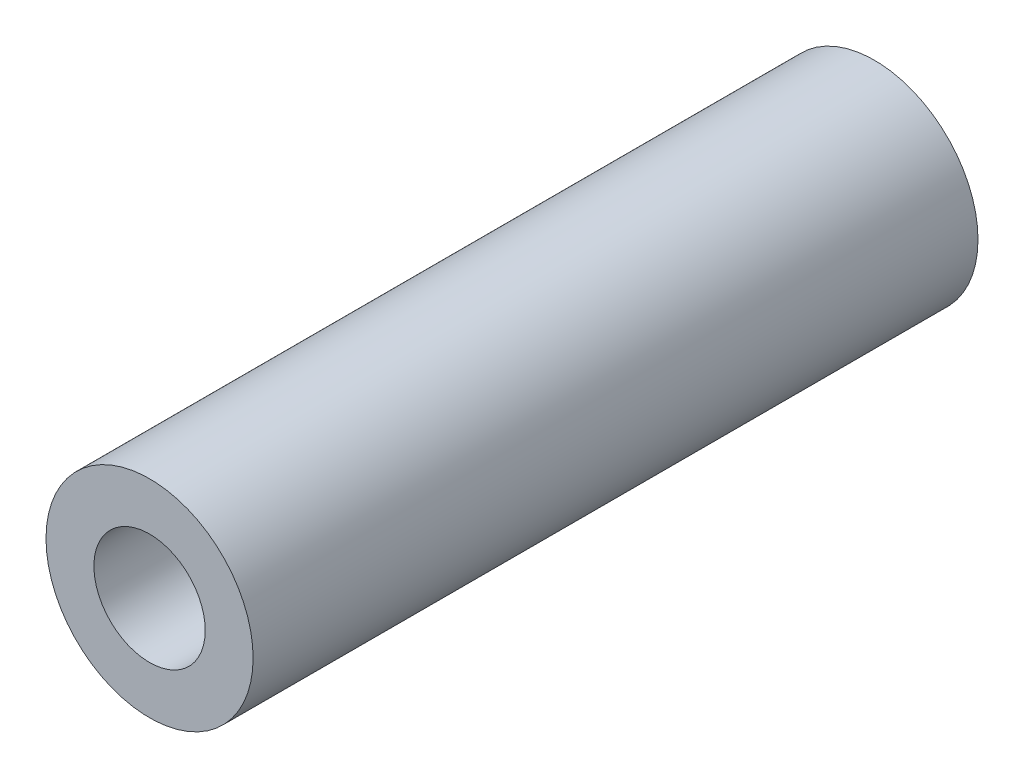
ISO-10303-21;
HEADER;
FILE_DESCRIPTION(('STEP AP214'),'2;1');
FILE_NAME('part.step','',(''),(''),'','','');
FILE_SCHEMA(('AUTOMOTIVE_DESIGN { 1 0 10303 214 1 1 1 1 }'));
ENDSEC;
DATA;
#1=APPLICATION_CONTEXT('core data for automotive mechanical design processes');
#2=APPLICATION_PROTOCOL_DEFINITION('international standard','automotive_design',2000,#1);
#3=PRODUCT_CONTEXT('',#1,'mechanical');
#4=PRODUCT('Part','Part','',(#3));
#5=PRODUCT_RELATED_PRODUCT_CATEGORY('part','',(#4));
#6=PRODUCT_DEFINITION_FORMATION('','',#4);
#7=PRODUCT_DEFINITION_CONTEXT('part definition',#1,'design');
#8=PRODUCT_DEFINITION('design','',#6,#7);
#9=PRODUCT_DEFINITION_SHAPE('','',#8);
#10=(LENGTH_UNIT() NAMED_UNIT(*) SI_UNIT(.MILLI.,.METRE.));
#11=(NAMED_UNIT(*) PLANE_ANGLE_UNIT() SI_UNIT($,.RADIAN.));
#12=(NAMED_UNIT(*) SI_UNIT($,.STERADIAN.) SOLID_ANGLE_UNIT());
#13=UNCERTAINTY_MEASURE_WITH_UNIT(LENGTH_MEASURE(1.E-05),#10,'distance_accuracy_value','');
#14=(GEOMETRIC_REPRESENTATION_CONTEXT(3) GLOBAL_UNCERTAINTY_ASSIGNED_CONTEXT((#13)) GLOBAL_UNIT_ASSIGNED_CONTEXT((#10,
#11,#12)) REPRESENTATION_CONTEXT('',''));
#15=CARTESIAN_POINT('',(0.,0.,0.));
#16=DIRECTION('',(0.,0.,1.));
#17=DIRECTION('',(1.,0.,0.));
#18=AXIS2_PLACEMENT_3D('',#15,#16,#17);
#19=CARTESIAN_POINT('',(0.,0.,28.));
#20=DIRECTION('',(0.,0.,1.));
#21=DIRECTION('',(1.,0.,0.));
#22=AXIS2_PLACEMENT_3D('',#19,#20,#21);
#23=PLANE('',#22);
#24=CARTESIAN_POINT('',(0.,0.,28.));
#25=DIRECTION('',(0.,0.,1.));
#26=DIRECTION('',(1.,0.,0.));
#27=AXIS2_PLACEMENT_3D('',#24,#25,#26);
#28=CIRCLE('',#27,4.);
#29=CARTESIAN_POINT('',(4.,0.,28.));
#30=VERTEX_POINT('',#29);
#31=EDGE_CURVE('E10',#30,#30,#28,.T.);
#32=ORIENTED_EDGE('',*,*,#31,.T.);
#33=EDGE_LOOP('',(#32));
#34=FACE_BOUND('',#33,.T.);
#35=CARTESIAN_POINT('',(0.,0.,28.));
#36=DIRECTION('',(0.,0.,1.));
#37=DIRECTION('',(1.,0.,0.));
#38=AXIS2_PLACEMENT_3D('',#35,#36,#37);
#39=CIRCLE('',#38,2.15);
#40=CARTESIAN_POINT('',(2.15,0.,28.));
#41=VERTEX_POINT('',#40);
#42=EDGE_CURVE('E53',#41,#41,#39,.T.);
#43=ORIENTED_EDGE('',*,*,#42,.F.);
#44=EDGE_LOOP('',(#43));
#45=FACE_BOUND('',#44,.T.);
#46=ADVANCED_FACE('F40',(#34,#45),#23,.T.);
#47=CARTESIAN_POINT('',(0.,0.,0.));
#48=DIRECTION('',(0.,0.,1.));
#49=DIRECTION('',(1.,0.,0.));
#50=AXIS2_PLACEMENT_3D('',#47,#48,#49);
#51=PLANE('',#50);
#52=CARTESIAN_POINT('',(0.,0.,0.));
#53=DIRECTION('',(0.,0.,1.));
#54=DIRECTION('',(1.,0.,0.));
#55=AXIS2_PLACEMENT_3D('',#52,#53,#54);
#56=CIRCLE('',#55,4.);
#57=CARTESIAN_POINT('',(4.,0.,0.));
#58=VERTEX_POINT('',#57);
#59=EDGE_CURVE('E44',#58,#58,#56,.T.);
#60=ORIENTED_EDGE('',*,*,#59,.F.);
#61=EDGE_LOOP('',(#60));
#62=FACE_BOUND('',#61,.T.);
#63=CARTESIAN_POINT('',(0.,0.,0.));
#64=DIRECTION('',(0.,0.,1.));
#65=DIRECTION('',(1.,0.,0.));
#66=AXIS2_PLACEMENT_3D('',#63,#64,#65);
#67=CIRCLE('',#66,2.15);
#68=CARTESIAN_POINT('',(2.15,0.,0.));
#69=VERTEX_POINT('',#68);
#70=EDGE_CURVE('E55',#69,#69,#67,.T.);
#71=ORIENTED_EDGE('',*,*,#70,.T.);
#72=EDGE_LOOP('',(#71));
#73=FACE_BOUND('',#72,.T.);
#74=ADVANCED_FACE('F67',(#62,#73),#51,.F.);
#75=CARTESIAN_POINT('',(0.,0.,28.));
#76=DIRECTION('',(0.,0.,-1.));
#77=DIRECTION('',(-1.,0.,0.));
#78=AXIS2_PLACEMENT_3D('',#75,#76,#77);
#79=CYLINDRICAL_SURFACE('',#78,4.);
#80=ORIENTED_EDGE('',*,*,#31,.F.);
#81=EDGE_LOOP('',(#80));
#82=FACE_BOUND('',#81,.T.);
#83=ORIENTED_EDGE('',*,*,#59,.T.);
#84=EDGE_LOOP('',(#83));
#85=FACE_BOUND('',#84,.T.);
#86=ADVANCED_FACE('F42',(#82,#85),#79,.T.);
#87=CARTESIAN_POINT('',(0.,0.,28.));
#88=DIRECTION('',(0.,0.,-1.));
#89=DIRECTION('',(-1.,0.,0.));
#90=AXIS2_PLACEMENT_3D('',#87,#88,#89);
#91=CYLINDRICAL_SURFACE('',#90,2.15);
#92=ORIENTED_EDGE('',*,*,#42,.T.);
#93=EDGE_LOOP('',(#92));
#94=FACE_BOUND('',#93,.T.);
#95=ORIENTED_EDGE('',*,*,#70,.F.);
#96=EDGE_LOOP('',(#95));
#97=FACE_BOUND('',#96,.T.);
#98=ADVANCED_FACE('F63',(#94,#97),#91,.F.);
#99=CLOSED_SHELL('',(#46,#74,#86,#98));
#100=MANIFOLD_SOLID_BREP('B2',#99);
#101=ADVANCED_BREP_SHAPE_REPRESENTATION('',(#18,#100),#14);
#102=SHAPE_DEFINITION_REPRESENTATION(#9,#101);
ENDSEC;
END-ISO-10303-21;
